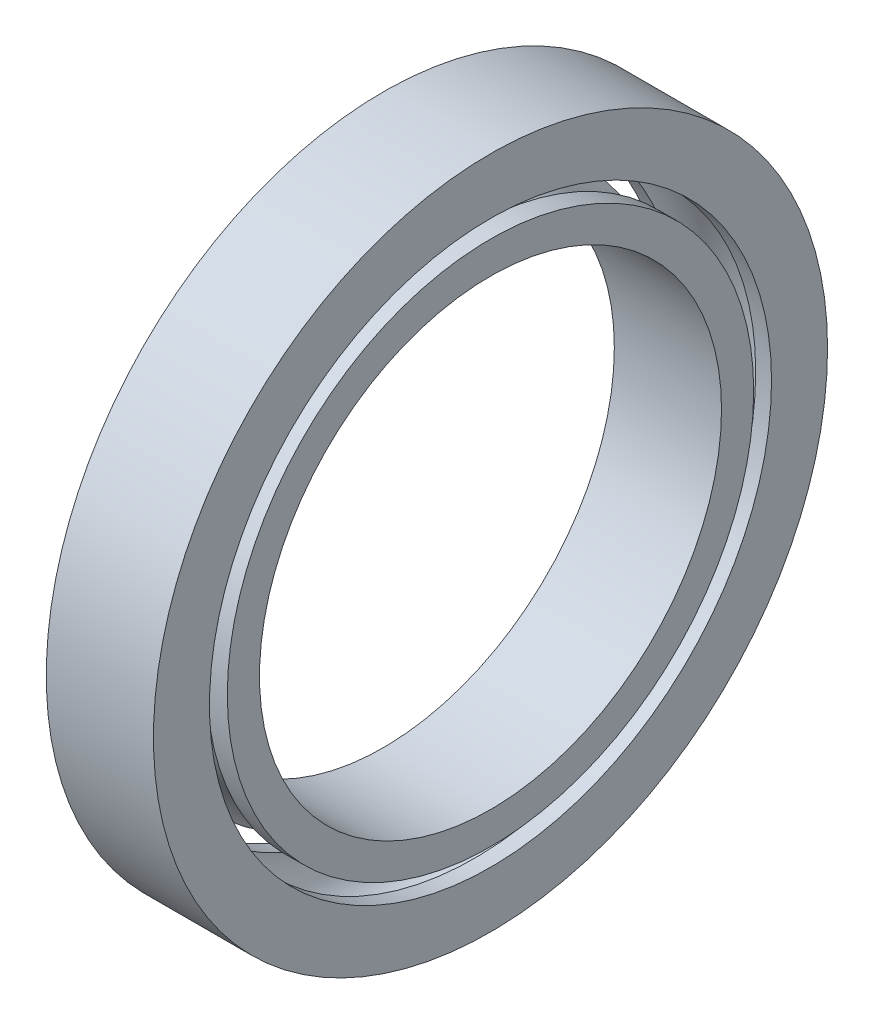
ISO-10303-21;
HEADER;
FILE_DESCRIPTION(('STEP AP214'),'2;1');
FILE_NAME('part.step','',(''),(''),'','','');
FILE_SCHEMA(('AUTOMOTIVE_DESIGN { 1 0 10303 214 1 1 1 1 }'));
ENDSEC;
DATA;
#1=APPLICATION_CONTEXT('core data for automotive mechanical design processes');
#2=APPLICATION_PROTOCOL_DEFINITION('international standard','automotive_design',2000,#1);
#3=PRODUCT_CONTEXT('',#1,'mechanical');
#4=PRODUCT('Part','Part','',(#3));
#5=PRODUCT_RELATED_PRODUCT_CATEGORY('part','',(#4));
#6=PRODUCT_DEFINITION_FORMATION('','',#4);
#7=PRODUCT_DEFINITION_CONTEXT('part definition',#1,'design');
#8=PRODUCT_DEFINITION('design','',#6,#7);
#9=PRODUCT_DEFINITION_SHAPE('','',#8);
#10=(LENGTH_UNIT() NAMED_UNIT(*) SI_UNIT(.MILLI.,.METRE.));
#11=(NAMED_UNIT(*) PLANE_ANGLE_UNIT() SI_UNIT($,.RADIAN.));
#12=(NAMED_UNIT(*) SI_UNIT($,.STERADIAN.) SOLID_ANGLE_UNIT());
#13=UNCERTAINTY_MEASURE_WITH_UNIT(LENGTH_MEASURE(1.E-05),#10,'distance_accuracy_value','');
#14=(GEOMETRIC_REPRESENTATION_CONTEXT(3) GLOBAL_UNCERTAINTY_ASSIGNED_CONTEXT((#13)) GLOBAL_UNIT_ASSIGNED_CONTEXT((#10,
#11,#12)) REPRESENTATION_CONTEXT('',''));
#15=CARTESIAN_POINT('',(0.,0.,0.));
#16=DIRECTION('',(0.,0.,1.));
#17=DIRECTION('',(1.,0.,0.));
#18=AXIS2_PLACEMENT_3D('',#15,#16,#17);
#19=CARTESIAN_POINT('',(0.,0.,0.));
#20=DIRECTION('',(1.,0.,0.));
#21=DIRECTION('',(0.,0.,-1.));
#22=AXIS2_PLACEMENT_3D('',#19,#20,#21);
#23=TOROIDAL_SURFACE('',#22,120.,16.1278313959806);
#24=CARTESIAN_POINT('',(-14.2169768976384,0.,0.));
#25=DIRECTION('',(1.,0.,0.));
#26=DIRECTION('',(0.,0.,-1.));
#27=AXIS2_PLACEMENT_3D('',#24,#25,#26);
#28=CIRCLE('',#27,112.3852437052);
#29=CARTESIAN_POINT('',(-14.2169768976384,0.,-112.3852437052));
#30=VERTEX_POINT('',#29);
#31=EDGE_CURVE('E11',#30,#30,#28,.T.);
#32=ORIENTED_EDGE('',*,*,#31,.T.);
#33=EDGE_LOOP('',(#32));
#34=FACE_BOUND('',#33,.T.);
#35=CARTESIAN_POINT('',(14.2169768976384,0.,0.));
#36=DIRECTION('',(1.,0.,0.));
#37=DIRECTION('',(0.,0.,-1.));
#38=AXIS2_PLACEMENT_3D('',#35,#36,#37);
#39=CIRCLE('',#38,112.3852437052);
#40=CARTESIAN_POINT('',(14.2169768976384,0.,-112.3852437052));
#41=VERTEX_POINT('',#40);
#42=EDGE_CURVE('E62',#41,#41,#39,.T.);
#43=ORIENTED_EDGE('',*,*,#42,.F.);
#44=EDGE_LOOP('',(#43));
#45=FACE_BOUND('',#44,.T.);
#46=ADVANCED_FACE('F40',(#34,#45),#23,.F.);
#47=CARTESIAN_POINT('',(89.1034841856424,0.,0.));
#48=DIRECTION('',(1.,0.,0.));
#49=DIRECTION('',(0.,0.,-1.));
#50=AXIS2_PLACEMENT_3D('',#47,#48,#49);
#51=CYLINDRICAL_SURFACE('',#50,112.3852437052);
#52=CARTESIAN_POINT('',(-22.8848662638776,0.,0.));
#53=DIRECTION('',(1.,0.,0.));
#54=DIRECTION('',(0.,0.,-1.));
#55=AXIS2_PLACEMENT_3D('',#52,#53,#54);
#56=CIRCLE('',#55,112.3852437052);
#57=CARTESIAN_POINT('',(-22.8848662638776,0.,-112.3852437052));
#58=VERTEX_POINT('',#57);
#59=EDGE_CURVE('E46',#58,#58,#56,.T.);
#60=ORIENTED_EDGE('',*,*,#59,.T.);
#61=EDGE_LOOP('',(#60));
#62=FACE_BOUND('',#61,.T.);
#63=ORIENTED_EDGE('',*,*,#31,.F.);
#64=EDGE_LOOP('',(#63));
#65=FACE_BOUND('',#64,.T.);
#66=ADVANCED_FACE('F70',(#62,#65),#51,.T.);
#67=CARTESIAN_POINT('',(-22.8848662638776,98.6433682212426,0.));
#68=DIRECTION('',(-1.,0.,0.));
#69=DIRECTION('',(0.,0.,1.));
#70=AXIS2_PLACEMENT_3D('',#67,#68,#69);
#71=PLANE('',#70);
#72=CARTESIAN_POINT('',(-22.8848662638776,0.,0.));
#73=DIRECTION('',(1.,0.,0.));
#74=DIRECTION('',(0.,0.,-1.));
#75=AXIS2_PLACEMENT_3D('',#72,#73,#74);
#76=CIRCLE('',#75,98.6433682212426);
#77=CARTESIAN_POINT('',(-22.8848662638776,0.,-98.6433682212426));
#78=VERTEX_POINT('',#77);
#79=EDGE_CURVE('E50',#78,#78,#76,.T.);
#80=ORIENTED_EDGE('',*,*,#79,.T.);
#81=EDGE_LOOP('',(#80));
#82=FACE_BOUND('',#81,.T.);
#83=ORIENTED_EDGE('',*,*,#59,.F.);
#84=EDGE_LOOP('',(#83));
#85=FACE_BOUND('',#84,.T.);
#86=ADVANCED_FACE('F74',(#82,#85),#71,.T.);
#87=CARTESIAN_POINT('',(89.1034841856424,0.,0.));
#88=DIRECTION('',(1.,0.,0.));
#89=DIRECTION('',(0.,0.,-1.));
#90=AXIS2_PLACEMENT_3D('',#87,#88,#89);
#91=CYLINDRICAL_SURFACE('',#90,98.6433682212426);
#92=CARTESIAN_POINT('',(22.8848662638776,0.,0.));
#93=DIRECTION('',(1.,0.,0.));
#94=DIRECTION('',(0.,0.,-1.));
#95=AXIS2_PLACEMENT_3D('',#92,#93,#94);
#96=CIRCLE('',#95,98.6433682212426);
#97=CARTESIAN_POINT('',(22.8848662638776,0.,-98.6433682212426));
#98=VERTEX_POINT('',#97);
#99=EDGE_CURVE('E54',#98,#98,#96,.T.);
#100=ORIENTED_EDGE('',*,*,#99,.T.);
#101=EDGE_LOOP('',(#100));
#102=FACE_BOUND('',#101,.T.);
#103=ORIENTED_EDGE('',*,*,#79,.F.);
#104=EDGE_LOOP('',(#103));
#105=FACE_BOUND('',#104,.T.);
#106=ADVANCED_FACE('F79',(#102,#105),#91,.F.);
#107=CARTESIAN_POINT('',(22.8848662638776,98.6433682212426,0.));
#108=DIRECTION('',(1.,0.,0.));
#109=DIRECTION('',(0.,0.,-1.));
#110=AXIS2_PLACEMENT_3D('',#107,#108,#109);
#111=PLANE('',#110);
#112=CARTESIAN_POINT('',(22.8848662638776,0.,0.));
#113=DIRECTION('',(1.,0.,0.));
#114=DIRECTION('',(0.,0.,-1.));
#115=AXIS2_PLACEMENT_3D('',#112,#113,#114);
#116=CIRCLE('',#115,112.3852437052);
#117=CARTESIAN_POINT('',(22.8848662638776,0.,-112.3852437052));
#118=VERTEX_POINT('',#117);
#119=EDGE_CURVE('E59',#118,#118,#116,.T.);
#120=ORIENTED_EDGE('',*,*,#119,.T.);
#121=EDGE_LOOP('',(#120));
#122=FACE_BOUND('',#121,.T.);
#123=ORIENTED_EDGE('',*,*,#99,.F.);
#124=EDGE_LOOP('',(#123));
#125=FACE_BOUND('',#124,.T.);
#126=ADVANCED_FACE('F86',(#122,#125),#111,.T.);
#127=CARTESIAN_POINT('',(89.1034841856424,0.,0.));
#128=DIRECTION('',(1.,0.,0.));
#129=DIRECTION('',(0.,0.,-1.));
#130=AXIS2_PLACEMENT_3D('',#127,#128,#129);
#131=CYLINDRICAL_SURFACE('',#130,112.3852437052);
#132=ORIENTED_EDGE('',*,*,#42,.T.);
#133=EDGE_LOOP('',(#132));
#134=FACE_BOUND('',#133,.T.);
#135=ORIENTED_EDGE('',*,*,#119,.F.);
#136=EDGE_LOOP('',(#135));
#137=FACE_BOUND('',#136,.T.);
#138=ADVANCED_FACE('F66',(#134,#137),#131,.T.);
#139=CLOSED_SHELL('',(#46,#66,#86,#106,#126,#138));
#140=MANIFOLD_SOLID_BREP('B2',#139);
#141=CARTESIAN_POINT('',(-22.8848662638776,120.,0.));
#142=DIRECTION('',(-1.,0.,0.));
#143=DIRECTION('',(0.,0.,1.));
#144=AXIS2_PLACEMENT_3D('',#141,#142,#143);
#145=PLANE('',#144);
#146=CARTESIAN_POINT('',(-22.8848662638776,0.,0.));
#147=DIRECTION('',(1.,0.,0.));
#148=DIRECTION('',(0.,0.,-1.));
#149=AXIS2_PLACEMENT_3D('',#146,#147,#148);
#150=CIRCLE('',#149,120.);
#151=CARTESIAN_POINT('',(-22.8848662638776,0.,-120.));
#152=VERTEX_POINT('',#151);
#153=EDGE_CURVE('E39',#152,#152,#150,.T.);
#154=ORIENTED_EDGE('',*,*,#153,.T.);
#155=EDGE_LOOP('',(#154));
#156=FACE_BOUND('',#155,.T.);
#157=CARTESIAN_POINT('',(-22.8848662638776,0.,0.));
#158=DIRECTION('',(1.,0.,0.));
#159=DIRECTION('',(0.,0.,-1.));
#160=AXIS2_PLACEMENT_3D('',#157,#158,#159);
#161=CIRCLE('',#160,143.921086161975);
#162=CARTESIAN_POINT('',(-22.8848662638776,0.,-143.921086161975));
#163=VERTEX_POINT('',#162);
#164=EDGE_CURVE('E157',#163,#163,#161,.T.);
#165=ORIENTED_EDGE('',*,*,#164,.F.);
#166=EDGE_LOOP('',(#165));
#167=FACE_BOUND('',#166,.T.);
#168=ADVANCED_FACE('F135',(#156,#167),#145,.T.);
#169=CARTESIAN_POINT('',(89.1034841856424,0.,0.));
#170=DIRECTION('',(1.,0.,0.));
#171=DIRECTION('',(0.,0.,-1.));
#172=AXIS2_PLACEMENT_3D('',#169,#170,#171);
#173=CYLINDRICAL_SURFACE('',#172,120.);
#174=CARTESIAN_POINT('',(-16.1278313959806,0.,0.));
#175=DIRECTION('',(1.,0.,0.));
#176=DIRECTION('',(0.,0.,-1.));
#177=AXIS2_PLACEMENT_3D('',#174,#175,#176);
#178=CIRCLE('',#177,120.);
#179=CARTESIAN_POINT('',(-16.1278313959806,0.,-120.));
#180=VERTEX_POINT('',#179);
#181=EDGE_CURVE('E141',#180,#180,#178,.T.);
#182=ORIENTED_EDGE('',*,*,#181,.T.);
#183=EDGE_LOOP('',(#182));
#184=FACE_BOUND('',#183,.T.);
#185=ORIENTED_EDGE('',*,*,#153,.F.);
#186=EDGE_LOOP('',(#185));
#187=FACE_BOUND('',#186,.T.);
#188=ADVANCED_FACE('F165',(#184,#187),#173,.F.);
#189=CARTESIAN_POINT('',(0.,0.,0.));
#190=DIRECTION('',(1.,0.,0.));
#191=DIRECTION('',(0.,0.,-1.));
#192=AXIS2_PLACEMENT_3D('',#189,#190,#191);
#193=TOROIDAL_SURFACE('',#192,120.,16.1278313959806);
#194=CARTESIAN_POINT('',(16.1278313959806,0.,0.));
#195=DIRECTION('',(1.,0.,0.));
#196=DIRECTION('',(0.,0.,-1.));
#197=AXIS2_PLACEMENT_3D('',#194,#195,#196);
#198=CIRCLE('',#197,120.);
#199=CARTESIAN_POINT('',(16.1278313959806,0.,-120.));
#200=VERTEX_POINT('',#199);
#201=EDGE_CURVE('E145',#200,#200,#198,.T.);
#202=ORIENTED_EDGE('',*,*,#201,.T.);
#203=EDGE_LOOP('',(#202));
#204=FACE_BOUND('',#203,.T.);
#205=ORIENTED_EDGE('',*,*,#181,.F.);
#206=EDGE_LOOP('',(#205));
#207=FACE_BOUND('',#206,.T.);
#208=ADVANCED_FACE('F169',(#204,#207),#193,.F.);
#209=CARTESIAN_POINT('',(89.1034841856424,0.,0.));
#210=DIRECTION('',(1.,0.,0.));
#211=DIRECTION('',(0.,0.,-1.));
#212=AXIS2_PLACEMENT_3D('',#209,#210,#211);
#213=CYLINDRICAL_SURFACE('',#212,120.);
#214=CARTESIAN_POINT('',(22.8848662638776,0.,0.));
#215=DIRECTION('',(1.,0.,0.));
#216=DIRECTION('',(0.,0.,-1.));
#217=AXIS2_PLACEMENT_3D('',#214,#215,#216);
#218=CIRCLE('',#217,120.);
#219=CARTESIAN_POINT('',(22.8848662638776,0.,-120.));
#220=VERTEX_POINT('',#219);
#221=EDGE_CURVE('E149',#220,#220,#218,.T.);
#222=ORIENTED_EDGE('',*,*,#221,.T.);
#223=EDGE_LOOP('',(#222));
#224=FACE_BOUND('',#223,.T.);
#225=ORIENTED_EDGE('',*,*,#201,.F.);
#226=EDGE_LOOP('',(#225));
#227=FACE_BOUND('',#226,.T.);
#228=ADVANCED_FACE('F173',(#224,#227),#213,.F.);
#229=CARTESIAN_POINT('',(22.8848662638776,120.,0.));
#230=DIRECTION('',(1.,0.,0.));
#231=DIRECTION('',(0.,0.,-1.));
#232=AXIS2_PLACEMENT_3D('',#229,#230,#231);
#233=PLANE('',#232);
#234=CARTESIAN_POINT('',(22.8848662638776,0.,0.));
#235=DIRECTION('',(1.,0.,0.));
#236=DIRECTION('',(0.,0.,-1.));
#237=AXIS2_PLACEMENT_3D('',#234,#235,#236);
#238=CIRCLE('',#237,143.921086161975);
#239=CARTESIAN_POINT('',(22.8848662638776,0.,-143.921086161975));
#240=VERTEX_POINT('',#239);
#241=EDGE_CURVE('E154',#240,#240,#238,.T.);
#242=ORIENTED_EDGE('',*,*,#241,.T.);
#243=EDGE_LOOP('',(#242));
#244=FACE_BOUND('',#243,.T.);
#245=ORIENTED_EDGE('',*,*,#221,.F.);
#246=EDGE_LOOP('',(#245));
#247=FACE_BOUND('',#246,.T.);
#248=ADVANCED_FACE('F180',(#244,#247),#233,.T.);
#249=CARTESIAN_POINT('',(89.1034841856424,0.,0.));
#250=DIRECTION('',(1.,0.,0.));
#251=DIRECTION('',(0.,0.,-1.));
#252=AXIS2_PLACEMENT_3D('',#249,#250,#251);
#253=CYLINDRICAL_SURFACE('',#252,143.921086161975);
#254=ORIENTED_EDGE('',*,*,#164,.T.);
#255=EDGE_LOOP('',(#254));
#256=FACE_BOUND('',#255,.T.);
#257=ORIENTED_EDGE('',*,*,#241,.F.);
#258=EDGE_LOOP('',(#257));
#259=FACE_BOUND('',#258,.T.);
#260=ADVANCED_FACE('F161',(#256,#259),#253,.T.);
#261=CLOSED_SHELL('',(#168,#188,#208,#228,#248,#260));
#262=MANIFOLD_SOLID_BREP('B6',#261);
#263=ADVANCED_BREP_SHAPE_REPRESENTATION('',(#18,#140,#262),#14);
#264=SHAPE_DEFINITION_REPRESENTATION(#9,#263);
ENDSEC;
END-ISO-10303-21;
